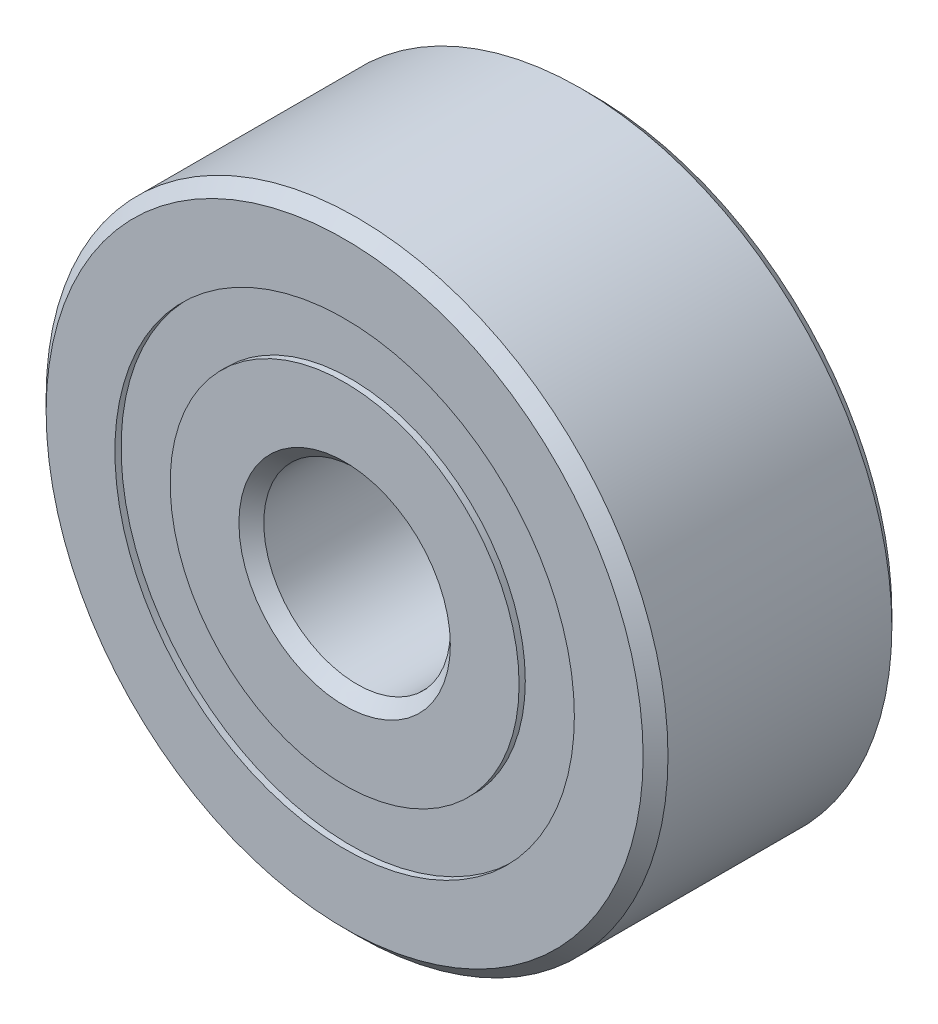
ISO-10303-21;
HEADER;
FILE_DESCRIPTION(('STEP AP214'),'2;1');
FILE_NAME('part.step','',(''),(''),'','','');
FILE_SCHEMA(('AUTOMOTIVE_DESIGN { 1 0 10303 214 1 1 1 1 }'));
ENDSEC;
DATA;
#1=APPLICATION_CONTEXT('core data for automotive mechanical design processes');
#2=APPLICATION_PROTOCOL_DEFINITION('international standard','automotive_design',2000,#1);
#3=PRODUCT_CONTEXT('',#1,'mechanical');
#4=PRODUCT('Part','Part','',(#3));
#5=PRODUCT_RELATED_PRODUCT_CATEGORY('part','',(#4));
#6=PRODUCT_DEFINITION_FORMATION('','',#4);
#7=PRODUCT_DEFINITION_CONTEXT('part definition',#1,'design');
#8=PRODUCT_DEFINITION('design','',#6,#7);
#9=PRODUCT_DEFINITION_SHAPE('','',#8);
#10=(LENGTH_UNIT() NAMED_UNIT(*) SI_UNIT(.MILLI.,.METRE.));
#11=(NAMED_UNIT(*) PLANE_ANGLE_UNIT() SI_UNIT($,.RADIAN.));
#12=(NAMED_UNIT(*) SI_UNIT($,.STERADIAN.) SOLID_ANGLE_UNIT());
#13=UNCERTAINTY_MEASURE_WITH_UNIT(LENGTH_MEASURE(1.E-05),#10,'distance_accuracy_value','');
#14=(GEOMETRIC_REPRESENTATION_CONTEXT(3) GLOBAL_UNCERTAINTY_ASSIGNED_CONTEXT((#13)) GLOBAL_UNIT_ASSIGNED_CONTEXT((#10,
#11,#12)) REPRESENTATION_CONTEXT('',''));
#15=CARTESIAN_POINT('',(0.,0.,0.));
#16=DIRECTION('',(0.,0.,1.));
#17=DIRECTION('',(1.,0.,0.));
#18=AXIS2_PLACEMENT_3D('',#15,#16,#17);
#19=CARTESIAN_POINT('',(0.,0.,1.8));
#20=DIRECTION('',(0.,0.,-1.));
#21=DIRECTION('',(-1.,0.,0.));
#22=AXIS2_PLACEMENT_3D('',#19,#20,#21);
#23=CONICAL_SURFACE('',#22,5.,0.785398163397438);
#24=CARTESIAN_POINT('',(0.,0.,2.));
#25=DIRECTION('',(0.,0.,1.));
#26=DIRECTION('',(1.,0.,0.));
#27=AXIS2_PLACEMENT_3D('',#24,#25,#26);
#28=CIRCLE('',#27,4.8);
#29=CARTESIAN_POINT('',(4.8,0.,2.));
#30=VERTEX_POINT('',#29);
#31=EDGE_CURVE('P0_E43',#30,#30,#28,.T.);
#32=ORIENTED_EDGE('',*,*,#31,.F.);
#33=EDGE_LOOP('',(#32));
#34=FACE_BOUND('',#33,.T.);
#35=CARTESIAN_POINT('',(0.,0.,1.8));
#36=DIRECTION('',(0.,0.,1.));
#37=DIRECTION('',(1.,0.,0.));
#38=AXIS2_PLACEMENT_3D('',#35,#36,#37);
#39=CIRCLE('',#38,5.);
#40=CARTESIAN_POINT('',(5.,0.,1.8));
#41=VERTEX_POINT('',#40);
#42=EDGE_CURVE('P0_E10',#41,#41,#39,.T.);
#43=ORIENTED_EDGE('',*,*,#42,.T.);
#44=EDGE_LOOP('',(#43));
#45=FACE_BOUND('',#44,.T.);
#46=ADVANCED_FACE('P0_F15',(#34,#45),#23,.T.);
#47=CARTESIAN_POINT('',(0.,0.,2.));
#48=DIRECTION('',(0.,0.,1.));
#49=DIRECTION('',(1.,0.,0.));
#50=AXIS2_PLACEMENT_3D('',#47,#48,#49);
#51=CYLINDRICAL_SURFACE('',#50,5.);
#52=ORIENTED_EDGE('',*,*,#42,.F.);
#53=EDGE_LOOP('',(#52));
#54=FACE_BOUND('',#53,.T.);
#55=CARTESIAN_POINT('',(0.,0.,-1.8));
#56=DIRECTION('',(0.,0.,1.));
#57=DIRECTION('',(1.,0.,0.));
#58=AXIS2_PLACEMENT_3D('',#55,#56,#57);
#59=CIRCLE('',#58,5.);
#60=CARTESIAN_POINT('',(5.,0.,-1.8));
#61=VERTEX_POINT('',#60);
#62=EDGE_CURVE('P0_E21',#61,#61,#59,.T.);
#63=ORIENTED_EDGE('',*,*,#62,.T.);
#64=EDGE_LOOP('',(#63));
#65=FACE_BOUND('',#64,.T.);
#66=ADVANCED_FACE('P0_F50',(#54,#65),#51,.T.);
#67=CARTESIAN_POINT('',(0.,0.,-2.));
#68=DIRECTION('',(0.,0.,1.));
#69=DIRECTION('',(1.,0.,0.));
#70=AXIS2_PLACEMENT_3D('',#67,#68,#69);
#71=CONICAL_SURFACE('',#70,4.8,0.785398163397438);
#72=ORIENTED_EDGE('',*,*,#62,.F.);
#73=EDGE_LOOP('',(#72));
#74=FACE_BOUND('',#73,.T.);
#75=CARTESIAN_POINT('',(0.,0.,-2.));
#76=DIRECTION('',(0.,0.,1.));
#77=DIRECTION('',(1.,0.,0.));
#78=AXIS2_PLACEMENT_3D('',#75,#76,#77);
#79=CIRCLE('',#78,4.8);
#80=CARTESIAN_POINT('',(4.8,0.,-2.));
#81=VERTEX_POINT('',#80);
#82=EDGE_CURVE('P0_E25',#81,#81,#79,.T.);
#83=ORIENTED_EDGE('',*,*,#82,.T.);
#84=EDGE_LOOP('',(#83));
#85=FACE_BOUND('',#84,.T.);
#86=ADVANCED_FACE('P0_F55',(#74,#85),#71,.T.);
#87=CARTESIAN_POINT('',(0.,4.8,-2.));
#88=DIRECTION('',(0.,0.,1.));
#89=DIRECTION('',(1.,0.,0.));
#90=AXIS2_PLACEMENT_3D('',#87,#88,#89);
#91=PLANE('',#90);
#92=ORIENTED_EDGE('',*,*,#82,.F.);
#93=EDGE_LOOP('',(#92));
#94=FACE_BOUND('',#93,.T.);
#95=CARTESIAN_POINT('',(0.,0.,-2.));
#96=DIRECTION('',(0.,0.,1.));
#97=DIRECTION('',(1.,0.,0.));
#98=AXIS2_PLACEMENT_3D('',#95,#96,#97);
#99=CIRCLE('',#98,3.69444444444444);
#100=CARTESIAN_POINT('',(3.69444444444444,0.,-2.));
#101=VERTEX_POINT('',#100);
#102=EDGE_CURVE('P0_E29',#101,#101,#99,.T.);
#103=ORIENTED_EDGE('',*,*,#102,.T.);
#104=EDGE_LOOP('',(#103));
#105=FACE_BOUND('',#104,.T.);
#106=ADVANCED_FACE('P0_F60',(#94,#105),#91,.F.);
#107=CARTESIAN_POINT('',(0.,0.,2.));
#108=DIRECTION('',(0.,0.,1.));
#109=DIRECTION('',(1.,0.,0.));
#110=AXIS2_PLACEMENT_3D('',#107,#108,#109);
#111=CYLINDRICAL_SURFACE('',#110,3.69444444444444);
#112=ORIENTED_EDGE('',*,*,#102,.F.);
#113=EDGE_LOOP('',(#112));
#114=FACE_BOUND('',#113,.T.);
#115=CARTESIAN_POINT('',(0.,0.,-0.888888888888893));
#116=DIRECTION('',(0.,0.,1.));
#117=DIRECTION('',(1.,0.,0.));
#118=AXIS2_PLACEMENT_3D('',#115,#116,#117);
#119=CIRCLE('',#118,3.69444444444444);
#120=CARTESIAN_POINT('',(3.69444444444444,0.,-0.888888888888893));
#121=VERTEX_POINT('',#120);
#122=EDGE_CURVE('P0_E34',#121,#121,#119,.T.);
#123=ORIENTED_EDGE('',*,*,#122,.T.);
#124=EDGE_LOOP('',(#123));
#125=FACE_BOUND('',#124,.T.);
#126=ADVANCED_FACE('P0_F66',(#114,#125),#111,.F.);
#127=CARTESIAN_POINT('',(0.,0.,0.));
#128=DIRECTION('',(0.,0.,1.));
#129=DIRECTION('',(1.,0.,0.));
#130=AXIS2_PLACEMENT_3D('',#127,#128,#129);
#131=TOROIDAL_SURFACE('',#130,3.25,0.993807989999903);
#132=ORIENTED_EDGE('',*,*,#122,.F.);
#133=EDGE_LOOP('',(#132));
#134=FACE_BOUND('',#133,.T.);
#135=CARTESIAN_POINT('',(0.,0.,0.888888888888884));
#136=DIRECTION('',(0.,0.,1.));
#137=DIRECTION('',(1.,0.,0.));
#138=AXIS2_PLACEMENT_3D('',#135,#136,#137);
#139=CIRCLE('',#138,3.69444444444444);
#140=CARTESIAN_POINT('',(3.69444444444444,0.,0.888888888888884));
#141=VERTEX_POINT('',#140);
#142=EDGE_CURVE('P0_E37',#141,#141,#139,.T.);
#143=ORIENTED_EDGE('',*,*,#142,.T.);
#144=EDGE_LOOP('',(#143));
#145=FACE_BOUND('',#144,.T.);
#146=ADVANCED_FACE('P0_F70',(#134,#145),#131,.F.);
#147=CARTESIAN_POINT('',(0.,0.,2.));
#148=DIRECTION('',(0.,0.,1.));
#149=DIRECTION('',(1.,0.,0.));
#150=AXIS2_PLACEMENT_3D('',#147,#148,#149);
#151=CYLINDRICAL_SURFACE('',#150,3.69444444444444);
#152=ORIENTED_EDGE('',*,*,#142,.F.);
#153=EDGE_LOOP('',(#152));
#154=FACE_BOUND('',#153,.T.);
#155=CARTESIAN_POINT('',(0.,0.,2.));
#156=DIRECTION('',(0.,0.,1.));
#157=DIRECTION('',(1.,0.,0.));
#158=AXIS2_PLACEMENT_3D('',#155,#156,#157);
#159=CIRCLE('',#158,3.69444444444444);
#160=CARTESIAN_POINT('',(3.69444444444444,0.,2.));
#161=VERTEX_POINT('',#160);
#162=EDGE_CURVE('P0_E40',#161,#161,#159,.T.);
#163=ORIENTED_EDGE('',*,*,#162,.T.);
#164=EDGE_LOOP('',(#163));
#165=FACE_BOUND('',#164,.T.);
#166=ADVANCED_FACE('P0_F74',(#154,#165),#151,.F.);
#167=CARTESIAN_POINT('',(0.,4.8,2.));
#168=DIRECTION('',(0.,0.,-1.));
#169=DIRECTION('',(-1.,0.,0.));
#170=AXIS2_PLACEMENT_3D('',#167,#168,#169);
#171=PLANE('',#170);
#172=ORIENTED_EDGE('',*,*,#162,.F.);
#173=EDGE_LOOP('',(#172));
#174=FACE_BOUND('',#173,.T.);
#175=ORIENTED_EDGE('',*,*,#31,.T.);
#176=EDGE_LOOP('',(#175));
#177=FACE_BOUND('',#176,.T.);
#178=ADVANCED_FACE('P0_F47',(#174,#177),#171,.F.);
#179=CLOSED_SHELL('',(#46,#66,#86,#106,#126,#146,#166,#178));
#180=MANIFOLD_SOLID_BREP('P0_B1',#179);
#181=CARTESIAN_POINT('',(-3.20062519728967,0.564356577417556,0.));
#182=DIRECTION('',(0.,0.,1.));
#183=DIRECTION('',(-0.984807753012206,0.173648177666941,0.));
#184=AXIS2_PLACEMENT_3D('',#181,#182,#183);
#185=SPHERICAL_SURFACE('',#184,0.9938079899999);
#186=CARTESIAN_POINT('',(-3.20062519728967,0.564356577417556,0.993807989999896));
#187=VERTEX_POINT('',#186);
#188=VERTEX_LOOP('',#187);
#189=FACE_BOUND('',#188,.T.);
#190=ADVANCED_FACE('P1_F12',(#189),#185,.T.);
#191=CLOSED_SHELL('',(#190));
#192=MANIFOLD_SOLID_BREP('P1_B1',#191);
#193=CARTESIAN_POINT('',(-2.08905973148122,2.48964444013671,0.));
#194=DIRECTION('',(0.,0.,1.));
#195=DIRECTION('',(-0.64278760968653,0.766044443118986,0.));
#196=AXIS2_PLACEMENT_3D('',#193,#194,#195);
#197=SPHERICAL_SURFACE('',#196,0.9938079899999);
#198=CARTESIAN_POINT('',(-2.08905973148122,2.48964444013671,0.993807989999896));
#199=VERTEX_POINT('',#198);
#200=VERTEX_LOOP('',#199);
#201=FACE_BOUND('',#200,.T.);
#202=ADVANCED_FACE('P2_F12',(#201),#197,.T.);
#203=CLOSED_SHELL('',(#202));
#204=MANIFOLD_SOLID_BREP('P2_B1',#203);
#205=CARTESIAN_POINT('',(0.,3.69444444444444,1.9));
#206=DIRECTION('',(0.,0.,-1.));
#207=DIRECTION('',(-1.,0.,0.));
#208=AXIS2_PLACEMENT_3D('',#205,#206,#207);
#209=PLANE('',#208);
#210=CARTESIAN_POINT('',(0.,0.,1.9));
#211=DIRECTION('',(0.,0.,1.));
#212=DIRECTION('',(1.,0.,0.));
#213=AXIS2_PLACEMENT_3D('',#210,#211,#212);
#214=CIRCLE('',#213,2.80555555555556);
#215=CARTESIAN_POINT('',(2.80555555555556,0.,1.9));
#216=VERTEX_POINT('',#215);
#217=EDGE_CURVE('P3_E10',#216,#216,#214,.T.);
#218=ORIENTED_EDGE('',*,*,#217,.F.);
#219=EDGE_LOOP('',(#218));
#220=FACE_BOUND('',#219,.T.);
#221=CARTESIAN_POINT('',(0.,0.,1.9));
#222=DIRECTION('',(0.,0.,1.));
#223=DIRECTION('',(1.,0.,0.));
#224=AXIS2_PLACEMENT_3D('',#221,#222,#223);
#225=CIRCLE('',#224,3.69444444444444);
#226=CARTESIAN_POINT('',(3.69444444444444,0.,1.9));
#227=VERTEX_POINT('',#226);
#228=EDGE_CURVE('P3_E28',#227,#227,#225,.T.);
#229=ORIENTED_EDGE('',*,*,#228,.T.);
#230=EDGE_LOOP('',(#229));
#231=FACE_BOUND('',#230,.T.);
#232=ADVANCED_FACE('P3_F14',(#220,#231),#209,.F.);
#233=CARTESIAN_POINT('',(0.,0.,2.));
#234=DIRECTION('',(0.,0.,1.));
#235=DIRECTION('',(1.,0.,0.));
#236=AXIS2_PLACEMENT_3D('',#233,#234,#235);
#237=CYLINDRICAL_SURFACE('',#236,2.80555555555556);
#238=CARTESIAN_POINT('',(0.,0.,0.993807989999899));
#239=DIRECTION('',(0.,0.,1.));
#240=DIRECTION('',(1.,0.,0.));
#241=AXIS2_PLACEMENT_3D('',#238,#239,#240);
#242=CIRCLE('',#241,2.80555555555556);
#243=CARTESIAN_POINT('',(2.80555555555556,0.,0.993807989999899));
#244=VERTEX_POINT('',#243);
#245=EDGE_CURVE('P3_E20',#244,#244,#242,.T.);
#246=ORIENTED_EDGE('',*,*,#245,.F.);
#247=EDGE_LOOP('',(#246));
#248=FACE_BOUND('',#247,.T.);
#249=ORIENTED_EDGE('',*,*,#217,.T.);
#250=EDGE_LOOP('',(#249));
#251=FACE_BOUND('',#250,.T.);
#252=ADVANCED_FACE('P3_F43',(#248,#251),#237,.F.);
#253=CARTESIAN_POINT('',(0.,3.69444444444444,0.993807989999899));
#254=DIRECTION('',(0.,0.,1.));
#255=DIRECTION('',(1.,0.,0.));
#256=AXIS2_PLACEMENT_3D('',#253,#254,#255);
#257=PLANE('',#256);
#258=CARTESIAN_POINT('',(0.,0.,0.993807989999899));
#259=DIRECTION('',(0.,0.,1.));
#260=DIRECTION('',(1.,0.,0.));
#261=AXIS2_PLACEMENT_3D('',#258,#259,#260);
#262=CIRCLE('',#261,3.69444444444444);
#263=CARTESIAN_POINT('',(3.69444444444444,0.,0.993807989999899));
#264=VERTEX_POINT('',#263);
#265=EDGE_CURVE('P3_E24',#264,#264,#262,.T.);
#266=ORIENTED_EDGE('',*,*,#265,.F.);
#267=EDGE_LOOP('',(#266));
#268=FACE_BOUND('',#267,.T.);
#269=ORIENTED_EDGE('',*,*,#245,.T.);
#270=EDGE_LOOP('',(#269));
#271=FACE_BOUND('',#270,.T.);
#272=ADVANCED_FACE('P3_F38',(#268,#271),#257,.F.);
#273=CARTESIAN_POINT('',(0.,0.,2.));
#274=DIRECTION('',(0.,0.,1.));
#275=DIRECTION('',(1.,0.,0.));
#276=AXIS2_PLACEMENT_3D('',#273,#274,#275);
#277=CYLINDRICAL_SURFACE('',#276,3.69444444444444);
#278=ORIENTED_EDGE('',*,*,#228,.F.);
#279=EDGE_LOOP('',(#278));
#280=FACE_BOUND('',#279,.T.);
#281=ORIENTED_EDGE('',*,*,#265,.T.);
#282=EDGE_LOOP('',(#281));
#283=FACE_BOUND('',#282,.T.);
#284=ADVANCED_FACE('P3_F35',(#280,#283),#277,.T.);
#285=CLOSED_SHELL('',(#232,#252,#272,#284));
#286=MANIFOLD_SOLID_BREP('P3_B1',#285);
#287=CARTESIAN_POINT('',(0.,3.69444444444444,-0.993807989999908));
#288=DIRECTION('',(0.,0.,-1.));
#289=DIRECTION('',(-1.,0.,0.));
#290=AXIS2_PLACEMENT_3D('',#287,#288,#289);
#291=PLANE('',#290);
#292=CARTESIAN_POINT('',(0.,0.,-0.993807989999909));
#293=DIRECTION('',(0.,0.,1.));
#294=DIRECTION('',(1.,0.,0.));
#295=AXIS2_PLACEMENT_3D('',#292,#293,#294);
#296=CIRCLE('',#295,2.80555555555556);
#297=CARTESIAN_POINT('',(2.80555555555556,0.,-0.993807989999909));
#298=VERTEX_POINT('',#297);
#299=EDGE_CURVE('P4_E10',#298,#298,#296,.T.);
#300=ORIENTED_EDGE('',*,*,#299,.F.);
#301=EDGE_LOOP('',(#300));
#302=FACE_BOUND('',#301,.T.);
#303=CARTESIAN_POINT('',(0.,0.,-0.993807989999908));
#304=DIRECTION('',(0.,0.,1.));
#305=DIRECTION('',(1.,0.,0.));
#306=AXIS2_PLACEMENT_3D('',#303,#304,#305);
#307=CIRCLE('',#306,3.69444444444444);
#308=CARTESIAN_POINT('',(3.69444444444444,0.,-0.993807989999908));
#309=VERTEX_POINT('',#308);
#310=EDGE_CURVE('P4_E28',#309,#309,#307,.T.);
#311=ORIENTED_EDGE('',*,*,#310,.T.);
#312=EDGE_LOOP('',(#311));
#313=FACE_BOUND('',#312,.T.);
#314=ADVANCED_FACE('P4_F14',(#302,#313),#291,.F.);
#315=CARTESIAN_POINT('',(0.,0.,2.));
#316=DIRECTION('',(0.,0.,1.));
#317=DIRECTION('',(1.,0.,0.));
#318=AXIS2_PLACEMENT_3D('',#315,#316,#317);
#319=CYLINDRICAL_SURFACE('',#318,2.80555555555556);
#320=CARTESIAN_POINT('',(0.,0.,-1.9));
#321=DIRECTION('',(0.,0.,1.));
#322=DIRECTION('',(1.,0.,0.));
#323=AXIS2_PLACEMENT_3D('',#320,#321,#322);
#324=CIRCLE('',#323,2.80555555555556);
#325=CARTESIAN_POINT('',(2.80555555555556,0.,-1.9));
#326=VERTEX_POINT('',#325);
#327=EDGE_CURVE('P4_E20',#326,#326,#324,.T.);
#328=ORIENTED_EDGE('',*,*,#327,.F.);
#329=EDGE_LOOP('',(#328));
#330=FACE_BOUND('',#329,.T.);
#331=ORIENTED_EDGE('',*,*,#299,.T.);
#332=EDGE_LOOP('',(#331));
#333=FACE_BOUND('',#332,.T.);
#334=ADVANCED_FACE('P4_F43',(#330,#333),#319,.F.);
#335=CARTESIAN_POINT('',(0.,3.69444444444444,-1.9));
#336=DIRECTION('',(0.,0.,1.));
#337=DIRECTION('',(1.,0.,0.));
#338=AXIS2_PLACEMENT_3D('',#335,#336,#337);
#339=PLANE('',#338);
#340=CARTESIAN_POINT('',(0.,0.,-1.9));
#341=DIRECTION('',(0.,0.,1.));
#342=DIRECTION('',(1.,0.,0.));
#343=AXIS2_PLACEMENT_3D('',#340,#341,#342);
#344=CIRCLE('',#343,3.69444444444444);
#345=CARTESIAN_POINT('',(3.69444444444444,0.,-1.9));
#346=VERTEX_POINT('',#345);
#347=EDGE_CURVE('P4_E24',#346,#346,#344,.T.);
#348=ORIENTED_EDGE('',*,*,#347,.F.);
#349=EDGE_LOOP('',(#348));
#350=FACE_BOUND('',#349,.T.);
#351=ORIENTED_EDGE('',*,*,#327,.T.);
#352=EDGE_LOOP('',(#351));
#353=FACE_BOUND('',#352,.T.);
#354=ADVANCED_FACE('P4_F38',(#350,#353),#339,.F.);
#355=CARTESIAN_POINT('',(0.,0.,2.));
#356=DIRECTION('',(0.,0.,1.));
#357=DIRECTION('',(1.,0.,0.));
#358=AXIS2_PLACEMENT_3D('',#355,#356,#357);
#359=CYLINDRICAL_SURFACE('',#358,3.69444444444444);
#360=ORIENTED_EDGE('',*,*,#310,.F.);
#361=EDGE_LOOP('',(#360));
#362=FACE_BOUND('',#361,.T.);
#363=ORIENTED_EDGE('',*,*,#347,.T.);
#364=EDGE_LOOP('',(#363));
#365=FACE_BOUND('',#364,.T.);
#366=ADVANCED_FACE('P4_F35',(#362,#365),#359,.T.);
#367=CLOSED_SHELL('',(#314,#334,#354,#366));
#368=MANIFOLD_SOLID_BREP('P4_B1',#367);
#369=CARTESIAN_POINT('',(0.,2.80555555555556,2.));
#370=DIRECTION('',(0.,0.,-1.));
#371=DIRECTION('',(-1.,0.,0.));
#372=AXIS2_PLACEMENT_3D('',#369,#370,#371);
#373=PLANE('',#372);
#374=CARTESIAN_POINT('',(0.,0.,2.));
#375=DIRECTION('',(0.,0.,1.));
#376=DIRECTION('',(1.,0.,0.));
#377=AXIS2_PLACEMENT_3D('',#374,#375,#376);
#378=CIRCLE('',#377,1.7);
#379=CARTESIAN_POINT('',(1.7,0.,2.));
#380=VERTEX_POINT('',#379);
#381=EDGE_CURVE('P5_E10',#380,#380,#378,.T.);
#382=ORIENTED_EDGE('',*,*,#381,.F.);
#383=EDGE_LOOP('',(#382));
#384=FACE_BOUND('',#383,.T.);
#385=CARTESIAN_POINT('',(0.,0.,2.));
#386=DIRECTION('',(0.,0.,1.));
#387=DIRECTION('',(1.,0.,0.));
#388=AXIS2_PLACEMENT_3D('',#385,#386,#387);
#389=CIRCLE('',#388,2.80555555555556);
#390=CARTESIAN_POINT('',(2.80555555555556,0.,2.));
#391=VERTEX_POINT('',#390);
#392=EDGE_CURVE('P5_E42',#391,#391,#389,.T.);
#393=ORIENTED_EDGE('',*,*,#392,.T.);
#394=EDGE_LOOP('',(#393));
#395=FACE_BOUND('',#394,.T.);
#396=ADVANCED_FACE('P5_F14',(#384,#395),#373,.F.);
#397=CARTESIAN_POINT('',(0.,0.,2.));
#398=DIRECTION('',(0.,0.,1.));
#399=DIRECTION('',(1.,0.,0.));
#400=AXIS2_PLACEMENT_3D('',#397,#398,#399);
#401=CONICAL_SURFACE('',#400,1.7,0.785398163397435);
#402=CARTESIAN_POINT('',(0.,0.,1.8));
#403=DIRECTION('',(0.,0.,1.));
#404=DIRECTION('',(1.,0.,0.));
#405=AXIS2_PLACEMENT_3D('',#402,#403,#404);
#406=CIRCLE('',#405,1.5);
#407=CARTESIAN_POINT('',(1.5,0.,1.8));
#408=VERTEX_POINT('',#407);
#409=EDGE_CURVE('P5_E20',#408,#408,#406,.T.);
#410=ORIENTED_EDGE('',*,*,#409,.F.);
#411=EDGE_LOOP('',(#410));
#412=FACE_BOUND('',#411,.T.);
#413=ORIENTED_EDGE('',*,*,#381,.T.);
#414=EDGE_LOOP('',(#413));
#415=FACE_BOUND('',#414,.T.);
#416=ADVANCED_FACE('P5_F79',(#412,#415),#401,.F.);
#417=CARTESIAN_POINT('',(0.,0.,2.));
#418=DIRECTION('',(0.,0.,1.));
#419=DIRECTION('',(1.,0.,0.));
#420=AXIS2_PLACEMENT_3D('',#417,#418,#419);
#421=CYLINDRICAL_SURFACE('',#420,1.5);
#422=CARTESIAN_POINT('',(0.,0.,-1.8));
#423=DIRECTION('',(0.,0.,1.));
#424=DIRECTION('',(1.,0.,0.));
#425=AXIS2_PLACEMENT_3D('',#422,#423,#424);
#426=CIRCLE('',#425,1.5);
#427=CARTESIAN_POINT('',(1.5,0.,-1.8));
#428=VERTEX_POINT('',#427);
#429=EDGE_CURVE('P5_E24',#428,#428,#426,.T.);
#430=ORIENTED_EDGE('',*,*,#429,.F.);
#431=EDGE_LOOP('',(#430));
#432=FACE_BOUND('',#431,.T.);
#433=ORIENTED_EDGE('',*,*,#409,.T.);
#434=EDGE_LOOP('',(#433));
#435=FACE_BOUND('',#434,.T.);
#436=ADVANCED_FACE('P5_F74',(#432,#435),#421,.F.);
#437=CARTESIAN_POINT('',(0.,0.,-1.8));
#438=DIRECTION('',(0.,0.,-1.));
#439=DIRECTION('',(-1.,0.,0.));
#440=AXIS2_PLACEMENT_3D('',#437,#438,#439);
#441=CONICAL_SURFACE('',#440,1.5,0.785398163397435);
#442=CARTESIAN_POINT('',(0.,0.,-2.));
#443=DIRECTION('',(0.,0.,1.));
#444=DIRECTION('',(1.,0.,0.));
#445=AXIS2_PLACEMENT_3D('',#442,#443,#444);
#446=CIRCLE('',#445,1.7);
#447=CARTESIAN_POINT('',(1.7,0.,-2.));
#448=VERTEX_POINT('',#447);
#449=EDGE_CURVE('P5_E28',#448,#448,#446,.T.);
#450=ORIENTED_EDGE('',*,*,#449,.F.);
#451=EDGE_LOOP('',(#450));
#452=FACE_BOUND('',#451,.T.);
#453=ORIENTED_EDGE('',*,*,#429,.T.);
#454=EDGE_LOOP('',(#453));
#455=FACE_BOUND('',#454,.T.);
#456=ADVANCED_FACE('P5_F68',(#452,#455),#441,.F.);
#457=CARTESIAN_POINT('',(0.,2.80555555555556,-2.));
#458=DIRECTION('',(0.,0.,1.));
#459=DIRECTION('',(1.,0.,0.));
#460=AXIS2_PLACEMENT_3D('',#457,#458,#459);
#461=PLANE('',#460);
#462=CARTESIAN_POINT('',(0.,0.,-2.));
#463=DIRECTION('',(0.,0.,1.));
#464=DIRECTION('',(1.,0.,0.));
#465=AXIS2_PLACEMENT_3D('',#462,#463,#464);
#466=CIRCLE('',#465,2.80555555555556);
#467=CARTESIAN_POINT('',(2.80555555555556,0.,-2.));
#468=VERTEX_POINT('',#467);
#469=EDGE_CURVE('P5_E33',#468,#468,#466,.T.);
#470=ORIENTED_EDGE('',*,*,#469,.F.);
#471=EDGE_LOOP('',(#470));
#472=FACE_BOUND('',#471,.T.);
#473=ORIENTED_EDGE('',*,*,#449,.T.);
#474=EDGE_LOOP('',(#473));
#475=FACE_BOUND('',#474,.T.);
#476=ADVANCED_FACE('P5_F62',(#472,#475),#461,.F.);
#477=CARTESIAN_POINT('',(0.,0.,2.));
#478=DIRECTION('',(0.,0.,1.));
#479=DIRECTION('',(1.,0.,0.));
#480=AXIS2_PLACEMENT_3D('',#477,#478,#479);
#481=CYLINDRICAL_SURFACE('',#480,2.80555555555556);
#482=CARTESIAN_POINT('',(0.,0.,-0.88888888888889));
#483=DIRECTION('',(0.,0.,1.));
#484=DIRECTION('',(1.,0.,0.));
#485=AXIS2_PLACEMENT_3D('',#482,#483,#484);
#486=CIRCLE('',#485,2.80555555555556);
#487=CARTESIAN_POINT('',(2.80555555555556,0.,-0.88888888888889));
#488=VERTEX_POINT('',#487);
#489=EDGE_CURVE('P5_E36',#488,#488,#486,.T.);
#490=ORIENTED_EDGE('',*,*,#489,.F.);
#491=EDGE_LOOP('',(#490));
#492=FACE_BOUND('',#491,.T.);
#493=ORIENTED_EDGE('',*,*,#469,.T.);
#494=EDGE_LOOP('',(#493));
#495=FACE_BOUND('',#494,.T.);
#496=ADVANCED_FACE('P5_F56',(#492,#495),#481,.T.);
#497=CARTESIAN_POINT('',(0.,0.,0.));
#498=DIRECTION('',(0.,0.,1.));
#499=DIRECTION('',(1.,0.,0.));
#500=AXIS2_PLACEMENT_3D('',#497,#498,#499);
#501=TOROIDAL_SURFACE('',#500,3.25,0.993807989999902);
#502=CARTESIAN_POINT('',(0.,0.,0.888888888888885));
#503=DIRECTION('',(0.,0.,1.));
#504=DIRECTION('',(1.,0.,0.));
#505=AXIS2_PLACEMENT_3D('',#502,#503,#504);
#506=CIRCLE('',#505,2.80555555555556);
#507=CARTESIAN_POINT('',(2.80555555555556,0.,0.888888888888885));
#508=VERTEX_POINT('',#507);
#509=EDGE_CURVE('P5_E39',#508,#508,#506,.T.);
#510=ORIENTED_EDGE('',*,*,#509,.F.);
#511=EDGE_LOOP('',(#510));
#512=FACE_BOUND('',#511,.T.);
#513=ORIENTED_EDGE('',*,*,#489,.T.);
#514=EDGE_LOOP('',(#513));
#515=FACE_BOUND('',#514,.T.);
#516=ADVANCED_FACE('P5_F50',(#512,#515),#501,.F.);
#517=CARTESIAN_POINT('',(0.,0.,2.));
#518=DIRECTION('',(0.,0.,1.));
#519=DIRECTION('',(1.,0.,0.));
#520=AXIS2_PLACEMENT_3D('',#517,#518,#519);
#521=CYLINDRICAL_SURFACE('',#520,2.80555555555556);
#522=ORIENTED_EDGE('',*,*,#392,.F.);
#523=EDGE_LOOP('',(#522));
#524=FACE_BOUND('',#523,.T.);
#525=ORIENTED_EDGE('',*,*,#509,.T.);
#526=EDGE_LOOP('',(#525));
#527=FACE_BOUND('',#526,.T.);
#528=ADVANCED_FACE('P5_F47',(#524,#527),#521,.T.);
#529=CLOSED_SHELL('',(#396,#416,#436,#456,#476,#496,#516,#528));
#530=MANIFOLD_SOLID_BREP('P5_B1',#529);
#531=CARTESIAN_POINT('',(0.,3.25,0.));
#532=DIRECTION('',(0.,0.,1.));
#533=DIRECTION('',(0.,1.,0.));
#534=AXIS2_PLACEMENT_3D('',#531,#532,#533);
#535=SPHERICAL_SURFACE('',#534,0.9938079899999);
#536=CARTESIAN_POINT('',(0.,3.25,0.993807989999896));
#537=VERTEX_POINT('',#536);
#538=VERTEX_LOOP('',#537);
#539=FACE_BOUND('',#538,.T.);
#540=ADVANCED_FACE('P6_F12',(#539),#535,.T.);
#541=CLOSED_SHELL('',(#540));
#542=MANIFOLD_SOLID_BREP('P6_B1',#541);
#543=CARTESIAN_POINT('',(2.08905973148125,2.48964444013667,0.));
#544=DIRECTION('',(0.,0.,1.));
#545=DIRECTION('',(0.642787609686541,0.766044443118977,0.));
#546=AXIS2_PLACEMENT_3D('',#543,#544,#545);
#547=SPHERICAL_SURFACE('',#546,0.9938079899999);
#548=CARTESIAN_POINT('',(2.08905973148125,2.48964444013667,0.993807989999896));
#549=VERTEX_POINT('',#548);
#550=VERTEX_LOOP('',#549);
#551=FACE_BOUND('',#550,.T.);
#552=ADVANCED_FACE('P7_F12',(#551),#547,.T.);
#553=CLOSED_SHELL('',(#552));
#554=MANIFOLD_SOLID_BREP('P7_B1',#553);
#555=CARTESIAN_POINT('',(3.20062519728967,0.564356577417514,0.));
#556=DIRECTION('',(0.,0.,1.));
#557=DIRECTION('',(0.984807753012209,0.173648177666928,0.));
#558=AXIS2_PLACEMENT_3D('',#555,#556,#557);
#559=SPHERICAL_SURFACE('',#558,0.9938079899999);
#560=CARTESIAN_POINT('',(3.20062519728967,0.564356577417514,0.993807989999896));
#561=VERTEX_POINT('',#560);
#562=VERTEX_LOOP('',#561);
#563=FACE_BOUND('',#562,.T.);
#564=ADVANCED_FACE('P8_F12',(#563),#559,.T.);
#565=CLOSED_SHELL('',(#564));
#566=MANIFOLD_SOLID_BREP('P8_B1',#565);
#567=CARTESIAN_POINT('',(2.81458256229942,-1.625,0.));
#568=DIRECTION('',(0.,0.,1.));
#569=DIRECTION('',(0.866025403784437,-0.5,0.));
#570=AXIS2_PLACEMENT_3D('',#567,#568,#569);
#571=SPHERICAL_SURFACE('',#570,0.9938079899999);
#572=CARTESIAN_POINT('',(2.81458256229942,-1.625,0.993807989999896));
#573=VERTEX_POINT('',#572);
#574=VERTEX_LOOP('',#573);
#575=FACE_BOUND('',#574,.T.);
#576=ADVANCED_FACE('P9_F12',(#575),#571,.T.);
#577=CLOSED_SHELL('',(#576));
#578=MANIFOLD_SOLID_BREP('P9_B1',#577);
#579=CARTESIAN_POINT('',(1.1115654658084,-3.05400101755421,0.));
#580=DIRECTION('',(0.,0.,1.));
#581=DIRECTION('',(0.342020143325663,-0.939692620785911,0.));
#582=AXIS2_PLACEMENT_3D('',#579,#580,#581);
#583=SPHERICAL_SURFACE('',#582,0.9938079899999);
#584=CARTESIAN_POINT('',(1.1115654658084,-3.05400101755421,0.993807989999896));
#585=VERTEX_POINT('',#584);
#586=VERTEX_LOOP('',#585);
#587=FACE_BOUND('',#586,.T.);
#588=ADVANCED_FACE('P10_F12',(#587),#583,.T.);
#589=CLOSED_SHELL('',(#588));
#590=MANIFOLD_SOLID_BREP('P10_B1',#589);
#591=CARTESIAN_POINT('',(-1.11156546580845,-3.0540010175542,0.));
#592=DIRECTION('',(0.,0.,1.));
#593=DIRECTION('',(-0.342020143325676,-0.939692620785906,0.));
#594=AXIS2_PLACEMENT_3D('',#591,#592,#593);
#595=SPHERICAL_SURFACE('',#594,0.9938079899999);
#596=CARTESIAN_POINT('',(-1.11156546580845,-3.0540010175542,0.993807989999896));
#597=VERTEX_POINT('',#596);
#598=VERTEX_LOOP('',#597);
#599=FACE_BOUND('',#598,.T.);
#600=ADVANCED_FACE('P11_F12',(#599),#595,.T.);
#601=CLOSED_SHELL('',(#600));
#602=MANIFOLD_SOLID_BREP('P11_B1',#601);
#603=CARTESIAN_POINT('',(-2.81458256229944,-1.62499999999997,0.));
#604=DIRECTION('',(0.,0.,1.));
#605=DIRECTION('',(-0.866025403784443,-0.499999999999992,0.));
#606=AXIS2_PLACEMENT_3D('',#603,#604,#605);
#607=SPHERICAL_SURFACE('',#606,0.9938079899999);
#608=CARTESIAN_POINT('',(-2.81458256229944,-1.62499999999997,0.993807989999896));
#609=VERTEX_POINT('',#608);
#610=VERTEX_LOOP('',#609);
#611=FACE_BOUND('',#610,.T.);
#612=ADVANCED_FACE('P12_F12',(#611),#607,.T.);
#613=CLOSED_SHELL('',(#612));
#614=MANIFOLD_SOLID_BREP('P12_B1',#613);
#615=ADVANCED_BREP_SHAPE_REPRESENTATION('',(#18,#180,#192,#204,#286,#368,#530,#542,#554,#566,
#578,#590,#602,#614),#14);
#616=SHAPE_DEFINITION_REPRESENTATION(#9,#615);
ENDSEC;
END-ISO-10303-21;
